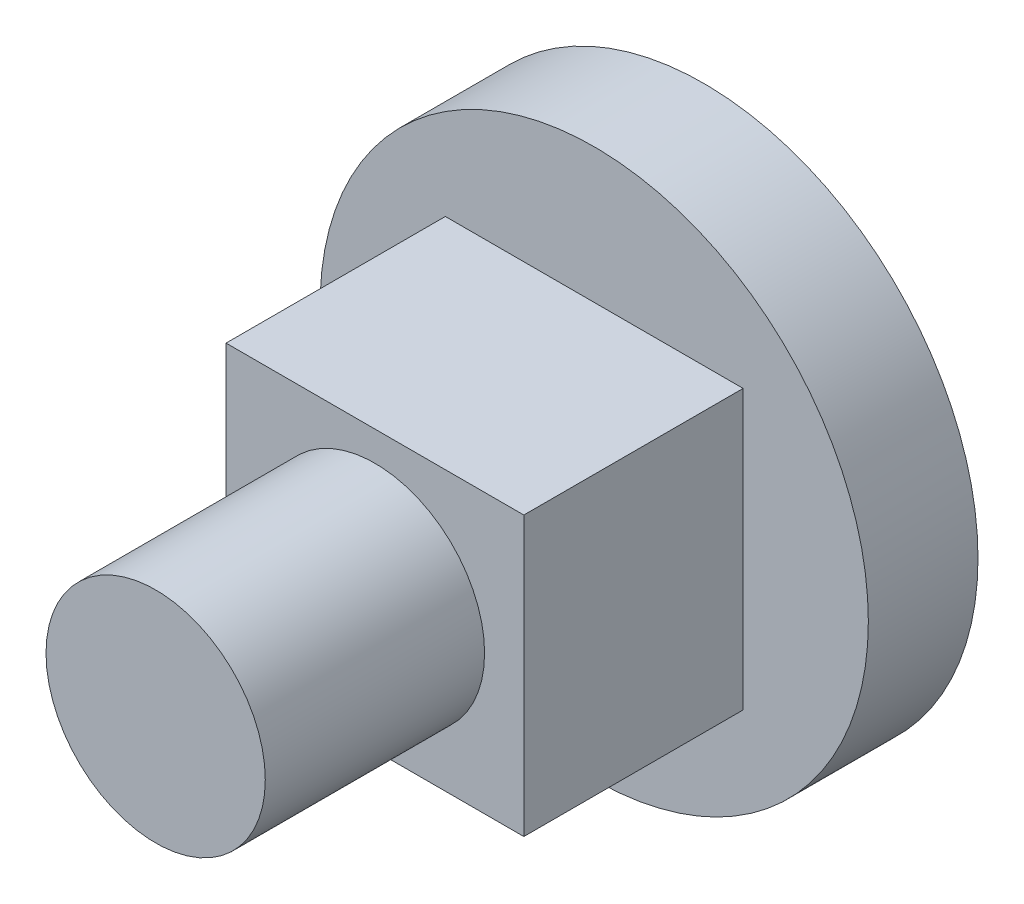
ISO-10303-21;
HEADER;
FILE_DESCRIPTION(('STEP AP214'),'2;1');
FILE_NAME('part.step','',(''),(''),'','','');
FILE_SCHEMA(('AUTOMOTIVE_DESIGN { 1 0 10303 214 1 1 1 1 }'));
ENDSEC;
DATA;
#1=APPLICATION_CONTEXT('core data for automotive mechanical design processes');
#2=APPLICATION_PROTOCOL_DEFINITION('international standard','automotive_design',2000,#1);
#3=PRODUCT_CONTEXT('',#1,'mechanical');
#4=PRODUCT('Part','Part','',(#3));
#5=PRODUCT_RELATED_PRODUCT_CATEGORY('part','',(#4));
#6=PRODUCT_DEFINITION_FORMATION('','',#4);
#7=PRODUCT_DEFINITION_CONTEXT('part definition',#1,'design');
#8=PRODUCT_DEFINITION('design','',#6,#7);
#9=PRODUCT_DEFINITION_SHAPE('','',#8);
#10=(LENGTH_UNIT() NAMED_UNIT(*) SI_UNIT(.MILLI.,.METRE.));
#11=(NAMED_UNIT(*) PLANE_ANGLE_UNIT() SI_UNIT($,.RADIAN.));
#12=(NAMED_UNIT(*) SI_UNIT($,.STERADIAN.) SOLID_ANGLE_UNIT());
#13=UNCERTAINTY_MEASURE_WITH_UNIT(LENGTH_MEASURE(1.E-05),#10,'distance_accuracy_value','');
#14=(GEOMETRIC_REPRESENTATION_CONTEXT(3) GLOBAL_UNCERTAINTY_ASSIGNED_CONTEXT((#13)) GLOBAL_UNIT_ASSIGNED_CONTEXT((#10,
#11,#12)) REPRESENTATION_CONTEXT('',''));
#15=CARTESIAN_POINT('',(0.,0.,0.));
#16=DIRECTION('',(0.,0.,1.));
#17=DIRECTION('',(1.,0.,0.));
#18=AXIS2_PLACEMENT_3D('',#15,#16,#17);
#19=CARTESIAN_POINT('',(0.,0.,5.));
#20=DIRECTION('',(0.,0.,-1.));
#21=DIRECTION('',(-1.,0.,0.));
#22=AXIS2_PLACEMENT_3D('',#19,#20,#21);
#23=CYLINDRICAL_SURFACE('',#22,1.);
#24=CARTESIAN_POINT('',(0.,0.,5.));
#25=DIRECTION('',(0.,0.,1.));
#26=DIRECTION('',(1.,0.,0.));
#27=AXIS2_PLACEMENT_3D('',#24,#25,#26);
#28=CIRCLE('',#27,1.);
#29=CARTESIAN_POINT('',(1.,0.,5.));
#30=VERTEX_POINT('',#29);
#31=EDGE_CURVE('E11',#30,#30,#28,.T.);
#32=ORIENTED_EDGE('',*,*,#31,.F.);
#33=EDGE_LOOP('',(#32));
#34=FACE_BOUND('',#33,.T.);
#35=CARTESIAN_POINT('',(0.,0.,3.));
#36=DIRECTION('',(0.,0.,1.));
#37=DIRECTION('',(1.,0.,0.));
#38=AXIS2_PLACEMENT_3D('',#35,#36,#37);
#39=CIRCLE('',#38,1.);
#40=CARTESIAN_POINT('',(1.,0.,3.));
#41=VERTEX_POINT('',#40);
#42=EDGE_CURVE('E51',#41,#41,#39,.T.);
#43=ORIENTED_EDGE('',*,*,#42,.T.);
#44=EDGE_LOOP('',(#43));
#45=FACE_BOUND('',#44,.T.);
#46=ADVANCED_FACE('F48',(#34,#45),#23,.T.);
#47=CARTESIAN_POINT('',(0.,0.,5.));
#48=DIRECTION('',(0.,0.,1.));
#49=DIRECTION('',(1.,0.,0.));
#50=AXIS2_PLACEMENT_3D('',#47,#48,#49);
#51=PLANE('',#50);
#52=ORIENTED_EDGE('',*,*,#31,.T.);
#53=EDGE_LOOP('',(#52));
#54=FACE_BOUND('',#53,.T.);
#55=ADVANCED_FACE('F63',(#54),#51,.T.);
#56=CARTESIAN_POINT('',(0.,0.,3.));
#57=DIRECTION('',(0.,0.,1.));
#58=DIRECTION('',(1.,0.,0.));
#59=AXIS2_PLACEMENT_3D('',#56,#57,#58);
#60=PLANE('',#59);
#61=ORIENTED_EDGE('',*,*,#42,.F.);
#62=EDGE_LOOP('',(#61));
#63=FACE_BOUND('',#62,.T.);
#64=ADVANCED_FACE('F61',(#63),#60,.F.);
#65=CLOSED_SHELL('',(#46,#55,#64));
#66=MANIFOLD_SOLID_BREP('B2',#65);
#67=CARTESIAN_POINT('',(0.,0.,1.));
#68=DIRECTION('',(0.,0.,-1.));
#69=DIRECTION('',(-1.,0.,0.));
#70=AXIS2_PLACEMENT_3D('',#67,#68,#69);
#71=CYLINDRICAL_SURFACE('',#70,2.5);
#72=CARTESIAN_POINT('',(0.,0.,1.));
#73=DIRECTION('',(0.,0.,1.));
#74=DIRECTION('',(1.,0.,0.));
#75=AXIS2_PLACEMENT_3D('',#72,#73,#74);
#76=CIRCLE('',#75,2.5);
#77=CARTESIAN_POINT('',(2.5,0.,1.));
#78=VERTEX_POINT('',#77);
#79=EDGE_CURVE('E47',#78,#78,#76,.T.);
#80=ORIENTED_EDGE('',*,*,#79,.F.);
#81=EDGE_LOOP('',(#80));
#82=FACE_BOUND('',#81,.T.);
#83=CARTESIAN_POINT('',(0.,0.,0.));
#84=DIRECTION('',(0.,0.,1.));
#85=DIRECTION('',(1.,0.,0.));
#86=AXIS2_PLACEMENT_3D('',#83,#84,#85);
#87=CIRCLE('',#86,2.5);
#88=CARTESIAN_POINT('',(2.5,0.,0.));
#89=VERTEX_POINT('',#88);
#90=EDGE_CURVE('E101',#89,#89,#87,.T.);
#91=ORIENTED_EDGE('',*,*,#90,.T.);
#92=EDGE_LOOP('',(#91));
#93=FACE_BOUND('',#92,.T.);
#94=ADVANCED_FACE('F98',(#82,#93),#71,.T.);
#95=CARTESIAN_POINT('',(0.,0.,1.));
#96=DIRECTION('',(0.,0.,1.));
#97=DIRECTION('',(1.,0.,0.));
#98=AXIS2_PLACEMENT_3D('',#95,#96,#97);
#99=PLANE('',#98);
#100=ORIENTED_EDGE('',*,*,#79,.T.);
#101=EDGE_LOOP('',(#100));
#102=FACE_BOUND('',#101,.T.);
#103=ADVANCED_FACE('F113',(#102),#99,.T.);
#104=CARTESIAN_POINT('',(0.,0.,0.));
#105=DIRECTION('',(0.,0.,1.));
#106=DIRECTION('',(1.,0.,0.));
#107=AXIS2_PLACEMENT_3D('',#104,#105,#106);
#108=PLANE('',#107);
#109=ORIENTED_EDGE('',*,*,#90,.F.);
#110=EDGE_LOOP('',(#109));
#111=FACE_BOUND('',#110,.T.);
#112=ADVANCED_FACE('F111',(#111),#108,.F.);
#113=CLOSED_SHELL('',(#94,#103,#112));
#114=MANIFOLD_SOLID_BREP('B6',#113);
#115=CARTESIAN_POINT('',(1.35792284982017,-1.26984050632473,3.));
#116=DIRECTION('',(0.,1.,0.));
#117=DIRECTION('',(0.,0.,1.));
#118=AXIS2_PLACEMENT_3D('',#115,#116,#117);
#119=PLANE('',#118);
#120=DIRECTION('',(1.,0.,0.));
#121=VECTOR('',#120,1.);
#122=CARTESIAN_POINT('',(1.35792284982017,-1.26984050632473,1.));
#123=LINE('',#122,#121);
#124=CARTESIAN_POINT('',(-1.35792284982017,-1.26984050632473,1.));
#125=VERTEX_POINT('',#124);
#126=CARTESIAN_POINT('',(1.35792284982017,-1.26984050632473,1.));
#127=VERTEX_POINT('',#126);
#128=EDGE_CURVE('E202',#125,#127,#123,.T.);
#129=ORIENTED_EDGE('',*,*,#128,.T.);
#130=DIRECTION('',(0.,0.,-1.));
#131=VECTOR('',#130,1.);
#132=CARTESIAN_POINT('',(1.35792284982017,-1.26984050632473,3.));
#133=LINE('',#132,#131);
#134=CARTESIAN_POINT('',(1.35792284982017,-1.26984050632473,3.));
#135=VERTEX_POINT('',#134);
#136=EDGE_CURVE('E96',#135,#127,#133,.T.);
#137=ORIENTED_EDGE('',*,*,#136,.F.);
#138=DIRECTION('',(1.,0.,0.));
#139=VECTOR('',#138,1.);
#140=CARTESIAN_POINT('',(1.35792284982017,-1.26984050632473,3.));
#141=LINE('',#140,#139);
#142=CARTESIAN_POINT('',(-1.35792284982017,-1.26984050632473,3.));
#143=VERTEX_POINT('',#142);
#144=EDGE_CURVE('E190',#143,#135,#141,.T.);
#145=ORIENTED_EDGE('',*,*,#144,.F.);
#146=DIRECTION('',(0.,0.,-1.));
#147=VECTOR('',#146,1.);
#148=CARTESIAN_POINT('',(-1.35792284982017,-1.26984050632473,3.));
#149=LINE('',#148,#147);
#150=EDGE_CURVE('E198',#143,#125,#149,.T.);
#151=ORIENTED_EDGE('',*,*,#150,.T.);
#152=EDGE_LOOP('',(#129,#137,#145,#151));
#153=FACE_BOUND('',#152,.T.);
#154=ADVANCED_FACE('F139',(#153),#119,.F.);
#155=CARTESIAN_POINT('',(1.35792284982017,-1.26984050632473,3.));
#156=DIRECTION('',(-1.,0.,0.));
#157=DIRECTION('',(0.,0.,1.));
#158=AXIS2_PLACEMENT_3D('',#155,#156,#157);
#159=PLANE('',#158);
#160=DIRECTION('',(0.,1.,0.));
#161=VECTOR('',#160,1.);
#162=CARTESIAN_POINT('',(1.35792284982017,-1.26984050632473,1.));
#163=LINE('',#162,#161);
#164=CARTESIAN_POINT('',(1.35792284982017,1.26984050632473,1.));
#165=VERTEX_POINT('',#164);
#166=EDGE_CURVE('E194',#127,#165,#163,.T.);
#167=ORIENTED_EDGE('',*,*,#166,.T.);
#168=DIRECTION('',(0.,0.,-1.));
#169=VECTOR('',#168,1.);
#170=CARTESIAN_POINT('',(1.35792284982017,1.26984050632473,3.));
#171=LINE('',#170,#169);
#172=CARTESIAN_POINT('',(1.35792284982017,1.26984050632473,3.));
#173=VERTEX_POINT('',#172);
#174=EDGE_CURVE('E147',#173,#165,#171,.T.);
#175=ORIENTED_EDGE('',*,*,#174,.F.);
#176=DIRECTION('',(0.,1.,0.));
#177=VECTOR('',#176,1.);
#178=CARTESIAN_POINT('',(1.35792284982017,-1.26984050632473,3.));
#179=LINE('',#178,#177);
#180=EDGE_CURVE('E185',#135,#173,#179,.T.);
#181=ORIENTED_EDGE('',*,*,#180,.F.);
#182=ORIENTED_EDGE('',*,*,#136,.T.);
#183=EDGE_LOOP('',(#167,#175,#181,#182));
#184=FACE_BOUND('',#183,.T.);
#185=ADVANCED_FACE('F193',(#184),#159,.F.);
#186=CARTESIAN_POINT('',(1.35792284982017,1.26984050632473,3.));
#187=DIRECTION('',(0.,-1.,0.));
#188=DIRECTION('',(0.,0.,-1.));
#189=AXIS2_PLACEMENT_3D('',#186,#187,#188);
#190=PLANE('',#189);
#191=DIRECTION('',(-1.,0.,0.));
#192=VECTOR('',#191,1.);
#193=CARTESIAN_POINT('',(1.35792284982017,1.26984050632473,1.));
#194=LINE('',#193,#192);
#195=CARTESIAN_POINT('',(-1.35792284982017,1.26984050632473,1.));
#196=VERTEX_POINT('',#195);
#197=EDGE_CURVE('E172',#165,#196,#194,.T.);
#198=ORIENTED_EDGE('',*,*,#197,.T.);
#199=DIRECTION('',(0.,0.,-1.));
#200=VECTOR('',#199,1.);
#201=CARTESIAN_POINT('',(-1.35792284982017,1.26984050632473,3.));
#202=LINE('',#201,#200);
#203=CARTESIAN_POINT('',(-1.35792284982017,1.26984050632473,3.));
#204=VERTEX_POINT('',#203);
#205=EDGE_CURVE('E195',#204,#196,#202,.T.);
#206=ORIENTED_EDGE('',*,*,#205,.F.);
#207=DIRECTION('',(-1.,0.,0.));
#208=VECTOR('',#207,1.);
#209=CARTESIAN_POINT('',(1.35792284982017,1.26984050632473,3.));
#210=LINE('',#209,#208);
#211=EDGE_CURVE('E188',#173,#204,#210,.T.);
#212=ORIENTED_EDGE('',*,*,#211,.F.);
#213=ORIENTED_EDGE('',*,*,#174,.T.);
#214=EDGE_LOOP('',(#198,#206,#212,#213));
#215=FACE_BOUND('',#214,.T.);
#216=ADVANCED_FACE('F196',(#215),#190,.F.);
#217=CARTESIAN_POINT('',(-1.35792284982017,-1.26984050632473,3.));
#218=DIRECTION('',(1.,0.,0.));
#219=DIRECTION('',(0.,0.,-1.));
#220=AXIS2_PLACEMENT_3D('',#217,#218,#219);
#221=PLANE('',#220);
#222=DIRECTION('',(0.,-1.,0.));
#223=VECTOR('',#222,1.);
#224=CARTESIAN_POINT('',(-1.35792284982017,-1.26984050632473,1.));
#225=LINE('',#224,#223);
#226=EDGE_CURVE('E178',#196,#125,#225,.T.);
#227=ORIENTED_EDGE('',*,*,#226,.T.);
#228=ORIENTED_EDGE('',*,*,#150,.F.);
#229=DIRECTION('',(0.,-1.,0.));
#230=VECTOR('',#229,1.);
#231=CARTESIAN_POINT('',(-1.35792284982017,-1.26984050632473,3.));
#232=LINE('',#231,#230);
#233=EDGE_CURVE('E155',#204,#143,#232,.T.);
#234=ORIENTED_EDGE('',*,*,#233,.F.);
#235=ORIENTED_EDGE('',*,*,#205,.T.);
#236=EDGE_LOOP('',(#227,#228,#234,#235));
#237=FACE_BOUND('',#236,.T.);
#238=ADVANCED_FACE('F209',(#237),#221,.F.);
#239=CARTESIAN_POINT('',(0.,0.,3.));
#240=DIRECTION('',(0.,0.,-1.));
#241=DIRECTION('',(-1.,0.,0.));
#242=AXIS2_PLACEMENT_3D('',#239,#240,#241);
#243=PLANE('',#242);
#244=ORIENTED_EDGE('',*,*,#144,.T.);
#245=ORIENTED_EDGE('',*,*,#180,.T.);
#246=ORIENTED_EDGE('',*,*,#211,.T.);
#247=ORIENTED_EDGE('',*,*,#233,.T.);
#248=EDGE_LOOP('',(#244,#245,#246,#247));
#249=FACE_BOUND('',#248,.T.);
#250=ADVANCED_FACE('F186',(#249),#243,.F.);
#251=CARTESIAN_POINT('',(0.,0.,1.));
#252=DIRECTION('',(0.,0.,-1.));
#253=DIRECTION('',(-1.,0.,0.));
#254=AXIS2_PLACEMENT_3D('',#251,#252,#253);
#255=PLANE('',#254);
#256=ORIENTED_EDGE('',*,*,#128,.F.);
#257=ORIENTED_EDGE('',*,*,#226,.F.);
#258=ORIENTED_EDGE('',*,*,#197,.F.);
#259=ORIENTED_EDGE('',*,*,#166,.F.);
#260=EDGE_LOOP('',(#256,#257,#258,#259));
#261=FACE_BOUND('',#260,.T.);
#262=ADVANCED_FACE('F212',(#261),#255,.T.);
#263=CLOSED_SHELL('',(#154,#185,#216,#238,#250,#262));
#264=MANIFOLD_SOLID_BREP('B42',#263);
#265=ADVANCED_BREP_SHAPE_REPRESENTATION('',(#18,#66,#114,#264),#14);
#266=SHAPE_DEFINITION_REPRESENTATION(#9,#265);
ENDSEC;
END-ISO-10303-21;
